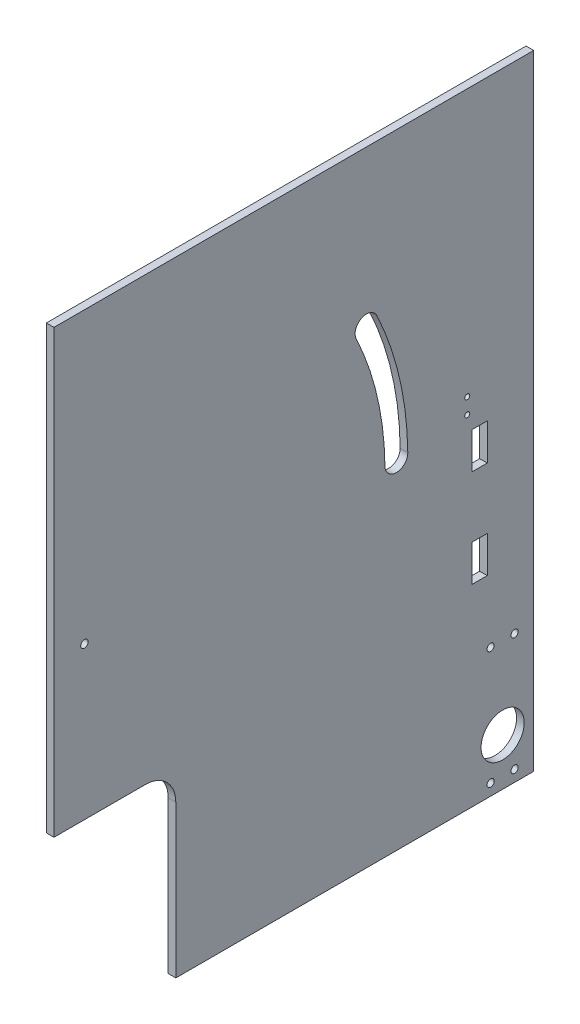
ISO-10303-21;
HEADER;
FILE_DESCRIPTION(('STEP AP214'),'2;1');
FILE_NAME('part.step','',(''),(''),'','','');
FILE_SCHEMA(('AUTOMOTIVE_DESIGN { 1 0 10303 214 1 1 1 1 }'));
ENDSEC;
DATA;
#1=APPLICATION_CONTEXT('core data for automotive mechanical design processes');
#2=APPLICATION_PROTOCOL_DEFINITION('international standard','automotive_design',2000,#1);
#3=PRODUCT_CONTEXT('',#1,'mechanical');
#4=PRODUCT('Part','Part','',(#3));
#5=PRODUCT_RELATED_PRODUCT_CATEGORY('part','',(#4));
#6=PRODUCT_DEFINITION_FORMATION('','',#4);
#7=PRODUCT_DEFINITION_CONTEXT('part definition',#1,'design');
#8=PRODUCT_DEFINITION('design','',#6,#7);
#9=PRODUCT_DEFINITION_SHAPE('','',#8);
#10=(LENGTH_UNIT() NAMED_UNIT(*) SI_UNIT(.MILLI.,.METRE.));
#11=(NAMED_UNIT(*) PLANE_ANGLE_UNIT() SI_UNIT($,.RADIAN.));
#12=(NAMED_UNIT(*) SI_UNIT($,.STERADIAN.) SOLID_ANGLE_UNIT());
#13=UNCERTAINTY_MEASURE_WITH_UNIT(LENGTH_MEASURE(1.E-05),#10,'distance_accuracy_value','');
#14=(GEOMETRIC_REPRESENTATION_CONTEXT(3) GLOBAL_UNCERTAINTY_ASSIGNED_CONTEXT((#13)) GLOBAL_UNIT_ASSIGNED_CONTEXT((#10,
#11,#12)) REPRESENTATION_CONTEXT('',''));
#15=CARTESIAN_POINT('',(0.,0.,0.));
#16=DIRECTION('',(0.,0.,1.));
#17=DIRECTION('',(1.,0.,0.));
#18=AXIS2_PLACEMENT_3D('',#15,#16,#17);
#19=CARTESIAN_POINT('',(3.175,0.,0.));
#20=DIRECTION('',(1.,0.,0.));
#21=DIRECTION('',(0.,0.,-1.));
#22=AXIS2_PLACEMENT_3D('',#19,#20,#21);
#23=PLANE('',#22);
#24=CARTESIAN_POINT('',(3.175,-76.4125,-82.075));
#25=DIRECTION('',(1.,0.,0.));
#26=DIRECTION('',(0.,0.,-1.));
#27=AXIS2_PLACEMENT_3D('',#24,#25,#26);
#28=CIRCLE('',#27,1.5);
#29=CARTESIAN_POINT('',(3.175,-76.4125,-83.575));
#30=VERTEX_POINT('',#29);
#31=EDGE_CURVE('E645',#30,#30,#28,.T.);
#32=ORIENTED_EDGE('',*,*,#31,.F.);
#33=EDGE_LOOP('',(#32));
#34=FACE_BOUND('',#33,.T.);
#35=CARTESIAN_POINT('',(3.175,-125.4125,-92.075));
#36=DIRECTION('',(1.,0.,0.));
#37=DIRECTION('',(0.,0.,-1.));
#38=AXIS2_PLACEMENT_3D('',#35,#36,#37);
#39=CIRCLE('',#38,1.5);
#40=CARTESIAN_POINT('',(3.175,-125.4125,-93.575));
#41=VERTEX_POINT('',#40);
#42=EDGE_CURVE('E650',#41,#41,#39,.T.);
#43=ORIENTED_EDGE('',*,*,#42,.F.);
#44=EDGE_LOOP('',(#43));
#45=FACE_BOUND('',#44,.T.);
#46=CARTESIAN_POINT('',(3.175,-76.4125,-92.075));
#47=DIRECTION('',(1.,0.,0.));
#48=DIRECTION('',(0.,0.,-1.));
#49=AXIS2_PLACEMENT_3D('',#46,#47,#48);
#50=CIRCLE('',#49,1.5);
#51=CARTESIAN_POINT('',(3.175,-76.4125,-93.575));
#52=VERTEX_POINT('',#51);
#53=EDGE_CURVE('E692',#52,#52,#50,.T.);
#54=ORIENTED_EDGE('',*,*,#53,.F.);
#55=EDGE_LOOP('',(#54));
#56=FACE_BOUND('',#55,.T.);
#57=CARTESIAN_POINT('',(3.175,-110.5624916,-87.075));
#58=DIRECTION('',(1.,0.,0.));
#59=DIRECTION('',(0.,0.,-1.));
#60=AXIS2_PLACEMENT_3D('',#57,#58,#59);
#61=CIRCLE('',#60,8.99999999999999);
#62=CARTESIAN_POINT('',(3.175,-110.5624916,-96.075));
#63=VERTEX_POINT('',#62);
#64=EDGE_CURVE('E701',#63,#63,#61,.T.);
#65=ORIENTED_EDGE('',*,*,#64,.F.);
#66=EDGE_LOOP('',(#65));
#67=FACE_BOUND('',#66,.T.);
#68=CARTESIAN_POINT('',(3.175,-125.4125,-82.075));
#69=DIRECTION('',(1.,0.,0.));
#70=DIRECTION('',(0.,0.,-1.));
#71=AXIS2_PLACEMENT_3D('',#68,#69,#70);
#72=CIRCLE('',#71,1.5);
#73=CARTESIAN_POINT('',(3.175,-125.4125,-83.575));
#74=VERTEX_POINT('',#73);
#75=EDGE_CURVE('E193',#74,#74,#72,.T.);
#76=ORIENTED_EDGE('',*,*,#75,.F.);
#77=EDGE_LOOP('',(#76));
#78=FACE_BOUND('',#77,.T.);
#79=DIRECTION('',(0.,-1.,0.));
#80=VECTOR('',#79,1.);
#81=CARTESIAN_POINT('',(3.175,6.07499420000002,-74.3175));
#82=LINE('',#81,#80);
#83=CARTESIAN_POINT('',(3.175,6.07499420000002,-74.3175));
#84=VERTEX_POINT('',#83);
#85=CARTESIAN_POINT('',(3.175,-9.16500579999998,-74.3175));
#86=VERTEX_POINT('',#85);
#87=EDGE_CURVE('E51',#84,#86,#82,.T.);
#88=ORIENTED_EDGE('',*,*,#87,.F.);
#89=DIRECTION('',(0.,0.,1.));
#90=VECTOR('',#89,1.);
#91=CARTESIAN_POINT('',(3.175,6.07499420000002,-74.3175));
#92=LINE('',#91,#90);
#93=CARTESIAN_POINT('',(3.175,6.07499420000002,-80.6675));
#94=VERTEX_POINT('',#93);
#95=EDGE_CURVE('E187',#94,#84,#92,.T.);
#96=ORIENTED_EDGE('',*,*,#95,.F.);
#97=DIRECTION('',(0.,1.,0.));
#98=VECTOR('',#97,1.);
#99=CARTESIAN_POINT('',(3.175,6.07499420000002,-80.6675));
#100=LINE('',#99,#98);
#101=CARTESIAN_POINT('',(3.175,-9.16500579999998,-80.6675));
#102=VERTEX_POINT('',#101);
#103=EDGE_CURVE('E190',#102,#94,#100,.T.);
#104=ORIENTED_EDGE('',*,*,#103,.F.);
#105=DIRECTION('',(0.,0.,-1.));
#106=VECTOR('',#105,1.);
#107=CARTESIAN_POINT('',(3.175,-9.16500579999998,-74.3175));
#108=LINE('',#107,#106);
#109=EDGE_CURVE('E199',#86,#102,#108,.T.);
#110=ORIENTED_EDGE('',*,*,#109,.F.);
#111=EDGE_LOOP('',(#88,#96,#104,#110));
#112=FACE_BOUND('',#111,.T.);
#113=DIRECTION('',(0.,-1.,0.));
#114=VECTOR('',#113,1.);
#115=CARTESIAN_POINT('',(3.175,-34.5650058,-74.3175));
#116=LINE('',#115,#114);
#117=CARTESIAN_POINT('',(3.175,-34.5650058,-74.3175));
#118=VERTEX_POINT('',#117);
#119=CARTESIAN_POINT('',(3.175,-49.8050058,-74.3175));
#120=VERTEX_POINT('',#119);
#121=EDGE_CURVE('E59',#118,#120,#116,.T.);
#122=ORIENTED_EDGE('',*,*,#121,.F.);
#123=DIRECTION('',(0.,0.,1.));
#124=VECTOR('',#123,1.);
#125=CARTESIAN_POINT('',(3.175,-34.5650058,-74.3175));
#126=LINE('',#125,#124);
#127=CARTESIAN_POINT('',(3.175,-34.5650058,-80.6675));
#128=VERTEX_POINT('',#127);
#129=EDGE_CURVE('E214',#128,#118,#126,.T.);
#130=ORIENTED_EDGE('',*,*,#129,.F.);
#131=DIRECTION('',(0.,1.,0.));
#132=VECTOR('',#131,1.);
#133=CARTESIAN_POINT('',(3.175,-34.5650058,-80.6675));
#134=LINE('',#133,#132);
#135=CARTESIAN_POINT('',(3.175,-49.8050058,-80.6675));
#136=VERTEX_POINT('',#135);
#137=EDGE_CURVE('E229',#136,#128,#134,.T.);
#138=ORIENTED_EDGE('',*,*,#137,.F.);
#139=DIRECTION('',(0.,0.,-1.));
#140=VECTOR('',#139,1.);
#141=CARTESIAN_POINT('',(3.175,-49.8050058,-74.3175));
#142=LINE('',#141,#140);
#143=EDGE_CURVE('E225',#120,#136,#142,.T.);
#144=ORIENTED_EDGE('',*,*,#143,.F.);
#145=EDGE_LOOP('',(#122,#130,#138,#144));
#146=FACE_BOUND('',#145,.T.);
#147=CARTESIAN_POINT('',(3.175,12.4249942,-72.3175));
#148=DIRECTION('',(-1.,0.,0.));
#149=DIRECTION('',(0.,0.,1.));
#150=AXIS2_PLACEMENT_3D('',#147,#148,#149);
#151=CIRCLE('',#150,1.04999790000001);
#152=CARTESIAN_POINT('',(3.175,12.4249942,-71.2675021));
#153=VERTEX_POINT('',#152);
#154=EDGE_CURVE('E300',#153,#153,#151,.T.);
#155=ORIENTED_EDGE('',*,*,#154,.T.);
#156=EDGE_LOOP('',(#155));
#157=FACE_BOUND('',#156,.T.);
#158=CARTESIAN_POINT('',(3.175,18.9250066,-72.3175));
#159=DIRECTION('',(-1.,0.,0.));
#160=DIRECTION('',(0.,0.,1.));
#161=AXIS2_PLACEMENT_3D('',#158,#159,#160);
#162=CIRCLE('',#161,1.04999790000001);
#163=CARTESIAN_POINT('',(3.175,18.9250066,-71.2675021));
#164=VERTEX_POINT('',#163);
#165=EDGE_CURVE('E294',#164,#164,#162,.T.);
#166=ORIENTED_EDGE('',*,*,#165,.T.);
#167=EDGE_LOOP('',(#166));
#168=FACE_BOUND('',#167,.T.);
#169=CARTESIAN_POINT('',(3.175,9.52500000000001,87.3125));
#170=DIRECTION('',(-1.,0.,0.));
#171=DIRECTION('',(0.,0.,1.));
#172=AXIS2_PLACEMENT_3D('',#169,#170,#171);
#173=CIRCLE('',#172,1.54999999999999);
#174=CARTESIAN_POINT('',(3.175,9.52500000000001,88.8625));
#175=VERTEX_POINT('',#174);
#176=EDGE_CURVE('E287',#175,#175,#173,.T.);
#177=ORIENTED_EDGE('',*,*,#176,.T.);
#178=EDGE_LOOP('',(#177));
#179=FACE_BOUND('',#178,.T.);
#180=DIRECTION('',(0.,0.,-1.));
#181=VECTOR('',#180,1.);
#182=CARTESIAN_POINT('',(3.175,-53.975,100.0125));
#183=LINE('',#182,#181);
#184=CARTESIAN_POINT('',(3.175,-53.975,100.0125));
#185=VERTEX_POINT('',#184);
#186=CARTESIAN_POINT('',(3.175,-53.975,61.9125));
#187=VERTEX_POINT('',#186);
#188=EDGE_CURVE('E272',#185,#187,#183,.T.);
#189=ORIENTED_EDGE('',*,*,#188,.T.);
#190=CARTESIAN_POINT('',(3.175,-66.675,61.9125));
#191=DIRECTION('',(1.,0.,0.));
#192=DIRECTION('',(0.,0.,-1.));
#193=AXIS2_PLACEMENT_3D('',#190,#191,#192);
#194=CIRCLE('',#193,12.7);
#195=CARTESIAN_POINT('',(3.175,-66.675,49.2125));
#196=VERTEX_POINT('',#195);
#197=EDGE_CURVE('E11',#187,#196,#194,.F.);
#198=ORIENTED_EDGE('',*,*,#197,.T.);
#199=DIRECTION('',(0.,-1.,0.));
#200=VECTOR('',#199,1.);
#201=CARTESIAN_POINT('',(3.175,-53.975,49.2125));
#202=LINE('',#201,#200);
#203=CARTESIAN_POINT('',(3.175,-130.175,49.2125));
#204=VERTEX_POINT('',#203);
#205=EDGE_CURVE('E275',#196,#204,#202,.T.);
#206=ORIENTED_EDGE('',*,*,#205,.T.);
#207=DIRECTION('',(0.,0.,-1.));
#208=VECTOR('',#207,1.);
#209=CARTESIAN_POINT('',(3.175,-130.175,100.0125));
#210=LINE('',#209,#208);
#211=CARTESIAN_POINT('',(3.175,-130.175,-100.0125));
#212=VERTEX_POINT('',#211);
#213=EDGE_CURVE('E308',#204,#212,#210,.T.);
#214=ORIENTED_EDGE('',*,*,#213,.T.);
#215=DIRECTION('',(0.,1.,0.));
#216=VECTOR('',#215,1.);
#217=CARTESIAN_POINT('',(3.175,130.175,-100.0125));
#218=LINE('',#217,#216);
#219=CARTESIAN_POINT('',(3.175,130.175,-100.0125));
#220=VERTEX_POINT('',#219);
#221=EDGE_CURVE('E311',#212,#220,#218,.T.);
#222=ORIENTED_EDGE('',*,*,#221,.T.);
#223=DIRECTION('',(0.,0.,1.));
#224=VECTOR('',#223,1.);
#225=CARTESIAN_POINT('',(3.175,130.175,100.0125));
#226=LINE('',#225,#224);
#227=CARTESIAN_POINT('',(3.175,130.175,100.0125));
#228=VERTEX_POINT('',#227);
#229=EDGE_CURVE('E313',#220,#228,#226,.T.);
#230=ORIENTED_EDGE('',*,*,#229,.T.);
#231=DIRECTION('',(0.,-1.,0.));
#232=VECTOR('',#231,1.);
#233=CARTESIAN_POINT('',(3.175,130.175,100.0125));
#234=LINE('',#233,#232);
#235=EDGE_CURVE('E305',#228,#185,#234,.T.);
#236=ORIENTED_EDGE('',*,*,#235,.T.);
#237=EDGE_LOOP('',(#189,#198,#206,#214,#222,#230,#236));
#238=FACE_BOUND('',#237,.T.);
#239=CARTESIAN_POINT('',(3.175,11.0871566045476,-42.7659721455072));
#240=DIRECTION('',(-1.,0.,0.));
#241=DIRECTION('',(0.,0.,1.));
#242=AXIS2_PLACEMENT_3D('',#239,#240,#241);
#243=CIRCLE('',#242,4.76250000000012);
#244=CARTESIAN_POINT('',(3.175,11.1443469625431,-47.5281287486601));
#245=VERTEX_POINT('',#244);
#246=CARTESIAN_POINT('',(3.175,11.0299662465522,-38.0038155423543));
#247=VERTEX_POINT('',#246);
#248=EDGE_CURVE('E240',#245,#247,#243,.T.);
#249=ORIENTED_EDGE('',*,*,#248,.T.);
#250=CARTESIAN_POINT('',(3.175,9.52500000000001,87.3125));
#251=DIRECTION('',(1.,0.,0.));
#252=DIRECTION('',(0.,0.,1.));
#253=AXIS2_PLACEMENT_3D('',#250,#251,#252);
#254=CIRCLE('',#253,125.325352042251);
#255=CARTESIAN_POINT('',(3.175,63.0289480343282,-26.017864021537));
#256=VERTEX_POINT('',#255);
#257=EDGE_CURVE('E243',#247,#256,#254,.T.);
#258=ORIENTED_EDGE('',*,*,#257,.T.);
#259=CARTESIAN_POINT('',(3.175,65.0621566045476,-30.3245412975802));
#260=DIRECTION('',(-1.,0.,0.));
#261=DIRECTION('',(0.,0.,-1.));
#262=AXIS2_PLACEMENT_3D('',#259,#260,#261);
#263=CIRCLE('',#262,4.76249999999999);
#264=CARTESIAN_POINT('',(3.175,67.0953649647199,-34.6312186727879));
#265=VERTEX_POINT('',#264);
#266=EDGE_CURVE('E247',#256,#265,#263,.T.);
#267=ORIENTED_EDGE('',*,*,#266,.T.);
#268=CARTESIAN_POINT('',(3.175,9.52500000000001,87.3125));
#269=DIRECTION('',(-1.,0.,0.));
#270=DIRECTION('',(0.,0.,1.));
#271=AXIS2_PLACEMENT_3D('',#268,#269,#270);
#272=CIRCLE('',#271,134.850352042251);
#273=EDGE_CURVE('E250',#265,#245,#272,.T.);
#274=ORIENTED_EDGE('',*,*,#273,.T.);
#275=EDGE_LOOP('',(#249,#258,#267,#274));
#276=FACE_BOUND('',#275,.T.);
#277=ADVANCED_FACE('F36',(#34,#45,#56,#67,#78,#112,#146,#157,#168,#179,#238,#276),#23,.T.);
#278=CARTESIAN_POINT('',(0.,0.,0.));
#279=DIRECTION('',(1.,0.,0.));
#280=DIRECTION('',(0.,0.,-1.));
#281=AXIS2_PLACEMENT_3D('',#278,#279,#280);
#282=PLANE('',#281);
#283=CARTESIAN_POINT('',(0.,-76.4125,-82.075));
#284=DIRECTION('',(1.,0.,0.));
#285=DIRECTION('',(0.,0.,-1.));
#286=AXIS2_PLACEMENT_3D('',#283,#284,#285);
#287=CIRCLE('',#286,1.5);
#288=CARTESIAN_POINT('',(0.,-76.4125,-83.575));
#289=VERTEX_POINT('',#288);
#290=EDGE_CURVE('E643',#289,#289,#287,.T.);
#291=ORIENTED_EDGE('',*,*,#290,.T.);
#292=EDGE_LOOP('',(#291));
#293=FACE_BOUND('',#292,.T.);
#294=CARTESIAN_POINT('',(0.,-125.4125,-92.075));
#295=DIRECTION('',(1.,0.,0.));
#296=DIRECTION('',(0.,0.,-1.));
#297=AXIS2_PLACEMENT_3D('',#294,#295,#296);
#298=CIRCLE('',#297,1.5);
#299=CARTESIAN_POINT('',(0.,-125.4125,-93.575));
#300=VERTEX_POINT('',#299);
#301=EDGE_CURVE('E646',#300,#300,#298,.T.);
#302=ORIENTED_EDGE('',*,*,#301,.T.);
#303=EDGE_LOOP('',(#302));
#304=FACE_BOUND('',#303,.T.);
#305=CARTESIAN_POINT('',(0.,-76.4125,-92.075));
#306=DIRECTION('',(1.,0.,0.));
#307=DIRECTION('',(0.,0.,-1.));
#308=AXIS2_PLACEMENT_3D('',#305,#306,#307);
#309=CIRCLE('',#308,1.5);
#310=CARTESIAN_POINT('',(0.,-76.4125,-93.575));
#311=VERTEX_POINT('',#310);
#312=EDGE_CURVE('E655',#311,#311,#309,.T.);
#313=ORIENTED_EDGE('',*,*,#312,.T.);
#314=EDGE_LOOP('',(#313));
#315=FACE_BOUND('',#314,.T.);
#316=CARTESIAN_POINT('',(0.,-110.5624916,-87.075));
#317=DIRECTION('',(1.,0.,0.));
#318=DIRECTION('',(0.,0.,-1.));
#319=AXIS2_PLACEMENT_3D('',#316,#317,#318);
#320=CIRCLE('',#319,8.99999999999999);
#321=CARTESIAN_POINT('',(0.,-110.5624916,-96.075));
#322=VERTEX_POINT('',#321);
#323=EDGE_CURVE('E697',#322,#322,#320,.T.);
#324=ORIENTED_EDGE('',*,*,#323,.T.);
#325=EDGE_LOOP('',(#324));
#326=FACE_BOUND('',#325,.T.);
#327=CARTESIAN_POINT('',(0.,-125.4125,-82.075));
#328=DIRECTION('',(1.,0.,0.));
#329=DIRECTION('',(0.,0.,-1.));
#330=AXIS2_PLACEMENT_3D('',#327,#328,#329);
#331=CIRCLE('',#330,1.5);
#332=CARTESIAN_POINT('',(0.,-125.4125,-83.575));
#333=VERTEX_POINT('',#332);
#334=EDGE_CURVE('E226',#333,#333,#331,.T.);
#335=ORIENTED_EDGE('',*,*,#334,.T.);
#336=EDGE_LOOP('',(#335));
#337=FACE_BOUND('',#336,.T.);
#338=DIRECTION('',(0.,0.,1.));
#339=VECTOR('',#338,1.);
#340=CARTESIAN_POINT('',(0.,6.07499420000002,-74.3175));
#341=LINE('',#340,#339);
#342=CARTESIAN_POINT('',(0.,6.07499420000002,-80.6675));
#343=VERTEX_POINT('',#342);
#344=CARTESIAN_POINT('',(0.,6.07499420000002,-74.3175));
#345=VERTEX_POINT('',#344);
#346=EDGE_CURVE('E174',#343,#345,#341,.T.);
#347=ORIENTED_EDGE('',*,*,#346,.T.);
#348=DIRECTION('',(0.,-1.,0.));
#349=VECTOR('',#348,1.);
#350=CARTESIAN_POINT('',(0.,6.07499420000002,-74.3175));
#351=LINE('',#350,#349);
#352=CARTESIAN_POINT('',(0.,-9.16500579999998,-74.3175));
#353=VERTEX_POINT('',#352);
#354=EDGE_CURVE('E168',#345,#353,#351,.T.);
#355=ORIENTED_EDGE('',*,*,#354,.T.);
#356=DIRECTION('',(0.,0.,-1.));
#357=VECTOR('',#356,1.);
#358=CARTESIAN_POINT('',(0.,-9.16500579999998,-74.3175));
#359=LINE('',#358,#357);
#360=CARTESIAN_POINT('',(0.,-9.16500579999998,-80.6675));
#361=VERTEX_POINT('',#360);
#362=EDGE_CURVE('E178',#353,#361,#359,.T.);
#363=ORIENTED_EDGE('',*,*,#362,.T.);
#364=DIRECTION('',(0.,1.,0.));
#365=VECTOR('',#364,1.);
#366=CARTESIAN_POINT('',(0.,6.07499420000002,-80.6675));
#367=LINE('',#366,#365);
#368=EDGE_CURVE('E182',#361,#343,#367,.T.);
#369=ORIENTED_EDGE('',*,*,#368,.T.);
#370=EDGE_LOOP('',(#347,#355,#363,#369));
#371=FACE_BOUND('',#370,.T.);
#372=DIRECTION('',(0.,0.,1.));
#373=VECTOR('',#372,1.);
#374=CARTESIAN_POINT('',(0.,-34.5650058,-74.3175));
#375=LINE('',#374,#373);
#376=CARTESIAN_POINT('',(0.,-34.5650058,-80.6675));
#377=VERTEX_POINT('',#376);
#378=CARTESIAN_POINT('',(0.,-34.5650058,-74.3175));
#379=VERTEX_POINT('',#378);
#380=EDGE_CURVE('E220',#377,#379,#375,.T.);
#381=ORIENTED_EDGE('',*,*,#380,.T.);
#382=DIRECTION('',(0.,-1.,0.));
#383=VECTOR('',#382,1.);
#384=CARTESIAN_POINT('',(0.,-34.5650058,-74.3175));
#385=LINE('',#384,#383);
#386=CARTESIAN_POINT('',(0.,-49.8050058,-74.3175));
#387=VERTEX_POINT('',#386);
#388=EDGE_CURVE('E210',#379,#387,#385,.T.);
#389=ORIENTED_EDGE('',*,*,#388,.T.);
#390=DIRECTION('',(0.,0.,-1.));
#391=VECTOR('',#390,1.);
#392=CARTESIAN_POINT('',(0.,-49.8050058,-74.3175));
#393=LINE('',#392,#391);
#394=CARTESIAN_POINT('',(0.,-49.8050058,-80.6675));
#395=VERTEX_POINT('',#394);
#396=EDGE_CURVE('E213',#387,#395,#393,.T.);
#397=ORIENTED_EDGE('',*,*,#396,.T.);
#398=DIRECTION('',(0.,1.,0.));
#399=VECTOR('',#398,1.);
#400=CARTESIAN_POINT('',(0.,-34.5650058,-80.6675));
#401=LINE('',#400,#399);
#402=EDGE_CURVE('E217',#395,#377,#401,.T.);
#403=ORIENTED_EDGE('',*,*,#402,.T.);
#404=EDGE_LOOP('',(#381,#389,#397,#403));
#405=FACE_BOUND('',#404,.T.);
#406=CARTESIAN_POINT('',(0.,9.52500000000001,87.3125));
#407=DIRECTION('',(-1.,0.,0.));
#408=DIRECTION('',(0.,0.,1.));
#409=AXIS2_PLACEMENT_3D('',#406,#407,#408);
#410=CIRCLE('',#409,1.54999999999999);
#411=CARTESIAN_POINT('',(0.,9.52500000000001,88.8625));
#412=VERTEX_POINT('',#411);
#413=EDGE_CURVE('E291',#412,#412,#410,.T.);
#414=ORIENTED_EDGE('',*,*,#413,.F.);
#415=EDGE_LOOP('',(#414));
#416=FACE_BOUND('',#415,.T.);
#417=CARTESIAN_POINT('',(0.,18.9250066,-72.3175));
#418=DIRECTION('',(-1.,0.,0.));
#419=DIRECTION('',(0.,0.,1.));
#420=AXIS2_PLACEMENT_3D('',#417,#418,#419);
#421=CIRCLE('',#420,1.04999790000001);
#422=CARTESIAN_POINT('',(0.,18.9250066,-71.2675021));
#423=VERTEX_POINT('',#422);
#424=EDGE_CURVE('E297',#423,#423,#421,.T.);
#425=ORIENTED_EDGE('',*,*,#424,.F.);
#426=EDGE_LOOP('',(#425));
#427=FACE_BOUND('',#426,.T.);
#428=CARTESIAN_POINT('',(0.,12.4249942,-72.3175));
#429=DIRECTION('',(-1.,0.,0.));
#430=DIRECTION('',(0.,0.,1.));
#431=AXIS2_PLACEMENT_3D('',#428,#429,#430);
#432=CIRCLE('',#431,1.04999790000001);
#433=CARTESIAN_POINT('',(0.,12.4249942,-71.2675021));
#434=VERTEX_POINT('',#433);
#435=EDGE_CURVE('E285',#434,#434,#432,.T.);
#436=ORIENTED_EDGE('',*,*,#435,.F.);
#437=EDGE_LOOP('',(#436));
#438=FACE_BOUND('',#437,.T.);
#439=DIRECTION('',(0.,0.,-1.));
#440=VECTOR('',#439,1.);
#441=CARTESIAN_POINT('',(0.,-130.175,100.0125));
#442=LINE('',#441,#440);
#443=CARTESIAN_POINT('',(0.,-130.175,49.2125));
#444=VERTEX_POINT('',#443);
#445=CARTESIAN_POINT('',(0.,-130.175,-100.0125));
#446=VERTEX_POINT('',#445);
#447=EDGE_CURVE('E318',#444,#446,#442,.T.);
#448=ORIENTED_EDGE('',*,*,#447,.F.);
#449=DIRECTION('',(0.,-1.,0.));
#450=VECTOR('',#449,1.);
#451=CARTESIAN_POINT('',(0.,-53.975,49.2125));
#452=LINE('',#451,#450);
#453=CARTESIAN_POINT('',(0.,-66.675,49.2125));
#454=VERTEX_POINT('',#453);
#455=EDGE_CURVE('E276',#454,#444,#452,.T.);
#456=ORIENTED_EDGE('',*,*,#455,.F.);
#457=CARTESIAN_POINT('',(0.,-66.675,61.9125));
#458=DIRECTION('',(1.,0.,0.));
#459=DIRECTION('',(0.,0.,-1.));
#460=AXIS2_PLACEMENT_3D('',#457,#458,#459);
#461=CIRCLE('',#460,12.7);
#462=CARTESIAN_POINT('',(0.,-53.975,61.9125));
#463=VERTEX_POINT('',#462);
#464=EDGE_CURVE('E44',#454,#463,#461,.T.);
#465=ORIENTED_EDGE('',*,*,#464,.T.);
#466=DIRECTION('',(0.,0.,-1.));
#467=VECTOR('',#466,1.);
#468=CARTESIAN_POINT('',(0.,-53.975,100.0125));
#469=LINE('',#468,#467);
#470=CARTESIAN_POINT('',(0.,-53.975,100.0125));
#471=VERTEX_POINT('',#470);
#472=EDGE_CURVE('E265',#471,#463,#469,.T.);
#473=ORIENTED_EDGE('',*,*,#472,.F.);
#474=DIRECTION('',(0.,-1.,0.));
#475=VECTOR('',#474,1.);
#476=CARTESIAN_POINT('',(0.,130.175,100.0125));
#477=LINE('',#476,#475);
#478=CARTESIAN_POINT('',(0.,130.175,100.0125));
#479=VERTEX_POINT('',#478);
#480=EDGE_CURVE('E290',#479,#471,#477,.T.);
#481=ORIENTED_EDGE('',*,*,#480,.F.);
#482=DIRECTION('',(0.,0.,1.));
#483=VECTOR('',#482,1.);
#484=CARTESIAN_POINT('',(0.,130.175,100.0125));
#485=LINE('',#484,#483);
#486=CARTESIAN_POINT('',(0.,130.175,-100.0125));
#487=VERTEX_POINT('',#486);
#488=EDGE_CURVE('E309',#487,#479,#485,.T.);
#489=ORIENTED_EDGE('',*,*,#488,.F.);
#490=DIRECTION('',(0.,1.,0.));
#491=VECTOR('',#490,1.);
#492=CARTESIAN_POINT('',(0.,130.175,-100.0125));
#493=LINE('',#492,#491);
#494=EDGE_CURVE('E320',#446,#487,#493,.T.);
#495=ORIENTED_EDGE('',*,*,#494,.F.);
#496=EDGE_LOOP('',(#448,#456,#465,#473,#481,#489,#495));
#497=FACE_BOUND('',#496,.T.);
#498=CARTESIAN_POINT('',(0.,9.52500000000001,87.3125));
#499=DIRECTION('',(1.,0.,0.));
#500=DIRECTION('',(0.,0.,1.));
#501=AXIS2_PLACEMENT_3D('',#498,#499,#500);
#502=CIRCLE('',#501,125.325352042251);
#503=CARTESIAN_POINT('',(0.,11.0299662465522,-38.0038155423543));
#504=VERTEX_POINT('',#503);
#505=CARTESIAN_POINT('',(0.,63.0289480343283,-26.017864021537));
#506=VERTEX_POINT('',#505);
#507=EDGE_CURVE('E255',#504,#506,#502,.T.);
#508=ORIENTED_EDGE('',*,*,#507,.F.);
#509=CARTESIAN_POINT('',(0.,11.0871566045476,-42.7659721455072));
#510=DIRECTION('',(-1.,0.,0.));
#511=DIRECTION('',(0.,0.,1.));
#512=AXIS2_PLACEMENT_3D('',#509,#510,#511);
#513=CIRCLE('',#512,4.76250000000012);
#514=CARTESIAN_POINT('',(0.,11.1443469625431,-47.5281287486601));
#515=VERTEX_POINT('',#514);
#516=EDGE_CURVE('E206',#515,#504,#513,.T.);
#517=ORIENTED_EDGE('',*,*,#516,.F.);
#518=CARTESIAN_POINT('',(0.,9.52500000000001,87.3125));
#519=DIRECTION('',(-1.,0.,0.));
#520=DIRECTION('',(0.,0.,1.));
#521=AXIS2_PLACEMENT_3D('',#518,#519,#520);
#522=CIRCLE('',#521,134.850352042251);
#523=CARTESIAN_POINT('',(0.,67.0953649647199,-34.6312186727879));
#524=VERTEX_POINT('',#523);
#525=EDGE_CURVE('E244',#524,#515,#522,.T.);
#526=ORIENTED_EDGE('',*,*,#525,.F.);
#527=CARTESIAN_POINT('',(0.,65.0621566045476,-30.3245412975802));
#528=DIRECTION('',(-1.,0.,0.));
#529=DIRECTION('',(0.,0.,-1.));
#530=AXIS2_PLACEMENT_3D('',#527,#528,#529);
#531=CIRCLE('',#530,4.76249999999999);
#532=EDGE_CURVE('E258',#506,#524,#531,.T.);
#533=ORIENTED_EDGE('',*,*,#532,.F.);
#534=EDGE_LOOP('',(#508,#517,#526,#533));
#535=FACE_BOUND('',#534,.T.);
#536=ADVANCED_FACE('F184',(#293,#304,#315,#326,#337,#371,#405,#416,#427,#438,#497,#535),#282,.F.);
#537=CARTESIAN_POINT('',(3.175,130.175,100.0125));
#538=DIRECTION('',(0.,0.,-1.));
#539=DIRECTION('',(-1.,0.,0.));
#540=AXIS2_PLACEMENT_3D('',#537,#538,#539);
#541=PLANE('',#540);
#542=ORIENTED_EDGE('',*,*,#480,.T.);
#543=DIRECTION('',(-1.,0.,0.));
#544=VECTOR('',#543,1.);
#545=CARTESIAN_POINT('',(3.175,-53.975,100.0125));
#546=LINE('',#545,#544);
#547=EDGE_CURVE('E278',#185,#471,#546,.T.);
#548=ORIENTED_EDGE('',*,*,#547,.F.);
#549=ORIENTED_EDGE('',*,*,#235,.F.);
#550=DIRECTION('',(-1.,0.,0.));
#551=VECTOR('',#550,1.);
#552=CARTESIAN_POINT('',(3.175,130.175,100.0125));
#553=LINE('',#552,#551);
#554=EDGE_CURVE('E315',#228,#479,#553,.T.);
#555=ORIENTED_EDGE('',*,*,#554,.T.);
#556=EDGE_LOOP('',(#542,#548,#549,#555));
#557=FACE_BOUND('',#556,.T.);
#558=ADVANCED_FACE('F370',(#557),#541,.F.);
#559=CARTESIAN_POINT('',(3.175,-130.175,100.0125));
#560=DIRECTION('',(0.,1.,0.));
#561=DIRECTION('',(0.,0.,1.));
#562=AXIS2_PLACEMENT_3D('',#559,#560,#561);
#563=PLANE('',#562);
#564=ORIENTED_EDGE('',*,*,#213,.F.);
#565=DIRECTION('',(-1.,0.,0.));
#566=VECTOR('',#565,1.);
#567=CARTESIAN_POINT('',(3.175,-130.175,49.2125));
#568=LINE('',#567,#566);
#569=EDGE_CURVE('E282',#204,#444,#568,.T.);
#570=ORIENTED_EDGE('',*,*,#569,.T.);
#571=ORIENTED_EDGE('',*,*,#447,.T.);
#572=DIRECTION('',(-1.,0.,0.));
#573=VECTOR('',#572,1.);
#574=CARTESIAN_POINT('',(3.175,-130.175,-100.0125));
#575=LINE('',#574,#573);
#576=EDGE_CURVE('E328',#212,#446,#575,.T.);
#577=ORIENTED_EDGE('',*,*,#576,.F.);
#578=EDGE_LOOP('',(#564,#570,#571,#577));
#579=FACE_BOUND('',#578,.T.);
#580=ADVANCED_FACE('F357',(#579),#563,.F.);
#581=CARTESIAN_POINT('',(3.175,130.175,-100.0125));
#582=DIRECTION('',(0.,0.,1.));
#583=DIRECTION('',(0.,-1.,0.));
#584=AXIS2_PLACEMENT_3D('',#581,#582,#583);
#585=PLANE('',#584);
#586=ORIENTED_EDGE('',*,*,#494,.T.);
#587=DIRECTION('',(-1.,0.,0.));
#588=VECTOR('',#587,1.);
#589=CARTESIAN_POINT('',(3.175,130.175,-100.0125));
#590=LINE('',#589,#588);
#591=EDGE_CURVE('E325',#220,#487,#590,.T.);
#592=ORIENTED_EDGE('',*,*,#591,.F.);
#593=ORIENTED_EDGE('',*,*,#221,.F.);
#594=ORIENTED_EDGE('',*,*,#576,.T.);
#595=EDGE_LOOP('',(#586,#592,#593,#594));
#596=FACE_BOUND('',#595,.T.);
#597=ADVANCED_FACE('F363',(#596),#585,.F.);
#598=CARTESIAN_POINT('',(3.175,130.175,100.0125));
#599=DIRECTION('',(0.,-1.,0.));
#600=DIRECTION('',(0.,0.,-1.));
#601=AXIS2_PLACEMENT_3D('',#598,#599,#600);
#602=PLANE('',#601);
#603=ORIENTED_EDGE('',*,*,#488,.T.);
#604=ORIENTED_EDGE('',*,*,#554,.F.);
#605=ORIENTED_EDGE('',*,*,#229,.F.);
#606=ORIENTED_EDGE('',*,*,#591,.T.);
#607=EDGE_LOOP('',(#603,#604,#605,#606));
#608=FACE_BOUND('',#607,.T.);
#609=ADVANCED_FACE('F367',(#608),#602,.F.);
#610=CARTESIAN_POINT('',(3.175,12.4249942,-72.3175));
#611=DIRECTION('',(-1.,0.,0.));
#612=DIRECTION('',(0.,0.,1.));
#613=AXIS2_PLACEMENT_3D('',#610,#611,#612);
#614=CYLINDRICAL_SURFACE('',#613,1.04999790000001);
#615=ORIENTED_EDGE('',*,*,#154,.F.);
#616=EDGE_LOOP('',(#615));
#617=FACE_BOUND('',#616,.T.);
#618=ORIENTED_EDGE('',*,*,#435,.T.);
#619=EDGE_LOOP('',(#618));
#620=FACE_BOUND('',#619,.T.);
#621=ADVANCED_FACE('F387',(#617,#620),#614,.F.);
#622=CARTESIAN_POINT('',(3.175,18.9250066,-72.3175));
#623=DIRECTION('',(-1.,0.,0.));
#624=DIRECTION('',(0.,0.,1.));
#625=AXIS2_PLACEMENT_3D('',#622,#623,#624);
#626=CYLINDRICAL_SURFACE('',#625,1.04999790000001);
#627=ORIENTED_EDGE('',*,*,#165,.F.);
#628=EDGE_LOOP('',(#627));
#629=FACE_BOUND('',#628,.T.);
#630=ORIENTED_EDGE('',*,*,#424,.T.);
#631=EDGE_LOOP('',(#630));
#632=FACE_BOUND('',#631,.T.);
#633=ADVANCED_FACE('F407',(#629,#632),#626,.F.);
#634=CARTESIAN_POINT('',(3.175,9.52500000000001,87.3125));
#635=DIRECTION('',(-1.,0.,0.));
#636=DIRECTION('',(0.,0.,1.));
#637=AXIS2_PLACEMENT_3D('',#634,#635,#636);
#638=CYLINDRICAL_SURFACE('',#637,1.54999999999999);
#639=ORIENTED_EDGE('',*,*,#176,.F.);
#640=EDGE_LOOP('',(#639));
#641=FACE_BOUND('',#640,.T.);
#642=ORIENTED_EDGE('',*,*,#413,.T.);
#643=EDGE_LOOP('',(#642));
#644=FACE_BOUND('',#643,.T.);
#645=ADVANCED_FACE('F414',(#641,#644),#638,.F.);
#646=CARTESIAN_POINT('',(3.175,-53.975,49.2125));
#647=DIRECTION('',(0.,0.,-1.));
#648=DIRECTION('',(0.,1.,0.));
#649=AXIS2_PLACEMENT_3D('',#646,#647,#648);
#650=PLANE('',#649);
#651=ORIENTED_EDGE('',*,*,#205,.F.);
#652=DIRECTION('',(-1.,0.,0.));
#653=VECTOR('',#652,1.);
#654=CARTESIAN_POINT('',(0.,-66.675,49.2125));
#655=LINE('',#654,#653);
#656=EDGE_CURVE('E331',#196,#454,#655,.T.);
#657=ORIENTED_EDGE('',*,*,#656,.T.);
#658=ORIENTED_EDGE('',*,*,#455,.T.);
#659=ORIENTED_EDGE('',*,*,#569,.F.);
#660=EDGE_LOOP('',(#651,#657,#658,#659));
#661=FACE_BOUND('',#660,.T.);
#662=ADVANCED_FACE('F353',(#661),#650,.F.);
#663=CARTESIAN_POINT('',(3.175,-53.975,100.0125));
#664=DIRECTION('',(0.,1.,0.));
#665=DIRECTION('',(0.,0.,1.));
#666=AXIS2_PLACEMENT_3D('',#663,#664,#665);
#667=PLANE('',#666);
#668=ORIENTED_EDGE('',*,*,#472,.T.);
#669=DIRECTION('',(-1.,0.,0.));
#670=VECTOR('',#669,1.);
#671=CARTESIAN_POINT('',(3.175,-53.975,61.9125));
#672=LINE('',#671,#670);
#673=EDGE_CURVE('E334',#463,#187,#672,.F.);
#674=ORIENTED_EDGE('',*,*,#673,.T.);
#675=ORIENTED_EDGE('',*,*,#188,.F.);
#676=ORIENTED_EDGE('',*,*,#547,.T.);
#677=EDGE_LOOP('',(#668,#674,#675,#676));
#678=FACE_BOUND('',#677,.T.);
#679=ADVANCED_FACE('F345',(#678),#667,.F.);
#680=CARTESIAN_POINT('',(3.175,-66.675,61.9125));
#681=DIRECTION('',(1.,0.,0.));
#682=DIRECTION('',(0.,0.,-1.));
#683=AXIS2_PLACEMENT_3D('',#680,#681,#682);
#684=CYLINDRICAL_SURFACE('',#683,12.7);
#685=ORIENTED_EDGE('',*,*,#197,.F.);
#686=ORIENTED_EDGE('',*,*,#673,.F.);
#687=ORIENTED_EDGE('',*,*,#464,.F.);
#688=ORIENTED_EDGE('',*,*,#656,.F.);
#689=EDGE_LOOP('',(#685,#686,#687,#688));
#690=FACE_BOUND('',#689,.T.);
#691=ADVANCED_FACE('F38',(#690),#684,.F.);
#692=CARTESIAN_POINT('',(3.175,11.0871566045476,-42.7659721455072));
#693=DIRECTION('',(-1.,0.,0.));
#694=DIRECTION('',(0.,0.,1.));
#695=AXIS2_PLACEMENT_3D('',#692,#693,#694);
#696=CYLINDRICAL_SURFACE('',#695,4.76250000000012);
#697=ORIENTED_EDGE('',*,*,#516,.T.);
#698=DIRECTION('',(-1.,0.,0.));
#699=VECTOR('',#698,1.);
#700=CARTESIAN_POINT('',(3.175,11.0299662465522,-38.0038155423543));
#701=LINE('',#700,#699);
#702=EDGE_CURVE('E253',#247,#504,#701,.T.);
#703=ORIENTED_EDGE('',*,*,#702,.F.);
#704=ORIENTED_EDGE('',*,*,#248,.F.);
#705=DIRECTION('',(-1.,0.,0.));
#706=VECTOR('',#705,1.);
#707=CARTESIAN_POINT('',(3.175,11.1443469625431,-47.5281287486601));
#708=LINE('',#707,#706);
#709=EDGE_CURVE('E263',#245,#515,#708,.T.);
#710=ORIENTED_EDGE('',*,*,#709,.T.);
#711=EDGE_LOOP('',(#697,#703,#704,#710));
#712=FACE_BOUND('',#711,.T.);
#713=ADVANCED_FACE('F440',(#712),#696,.F.);
#714=CARTESIAN_POINT('',(3.175,9.52500000000001,87.3125));
#715=DIRECTION('',(-1.,0.,0.));
#716=DIRECTION('',(0.,0.,1.));
#717=AXIS2_PLACEMENT_3D('',#714,#715,#716);
#718=CYLINDRICAL_SURFACE('',#717,134.850352042251);
#719=ORIENTED_EDGE('',*,*,#525,.T.);
#720=ORIENTED_EDGE('',*,*,#709,.F.);
#721=ORIENTED_EDGE('',*,*,#273,.F.);
#722=DIRECTION('',(-1.,0.,0.));
#723=VECTOR('',#722,1.);
#724=CARTESIAN_POINT('',(3.175,67.0953649647199,-34.6312186727879));
#725=LINE('',#724,#723);
#726=EDGE_CURVE('E266',#265,#524,#725,.T.);
#727=ORIENTED_EDGE('',*,*,#726,.T.);
#728=EDGE_LOOP('',(#719,#720,#721,#727));
#729=FACE_BOUND('',#728,.T.);
#730=ADVANCED_FACE('F446',(#729),#718,.F.);
#731=CARTESIAN_POINT('',(3.175,65.0621566045476,-30.3245412975802));
#732=DIRECTION('',(-1.,0.,0.));
#733=DIRECTION('',(0.,0.,1.));
#734=AXIS2_PLACEMENT_3D('',#731,#732,#733);
#735=CYLINDRICAL_SURFACE('',#734,4.76249999999999);
#736=ORIENTED_EDGE('',*,*,#532,.T.);
#737=ORIENTED_EDGE('',*,*,#726,.F.);
#738=ORIENTED_EDGE('',*,*,#266,.F.);
#739=DIRECTION('',(-1.,0.,0.));
#740=VECTOR('',#739,1.);
#741=CARTESIAN_POINT('',(3.175,63.0289480343283,-26.017864021537));
#742=LINE('',#741,#740);
#743=EDGE_CURVE('E268',#256,#506,#742,.T.);
#744=ORIENTED_EDGE('',*,*,#743,.T.);
#745=EDGE_LOOP('',(#736,#737,#738,#744));
#746=FACE_BOUND('',#745,.T.);
#747=ADVANCED_FACE('F454',(#746),#735,.F.);
#748=CARTESIAN_POINT('',(3.175,9.52500000000001,87.3125));
#749=DIRECTION('',(-1.,0.,0.));
#750=DIRECTION('',(0.,0.,1.));
#751=AXIS2_PLACEMENT_3D('',#748,#749,#750);
#752=CYLINDRICAL_SURFACE('',#751,125.325352042251);
#753=ORIENTED_EDGE('',*,*,#507,.T.);
#754=ORIENTED_EDGE('',*,*,#743,.F.);
#755=ORIENTED_EDGE('',*,*,#257,.F.);
#756=ORIENTED_EDGE('',*,*,#702,.T.);
#757=EDGE_LOOP('',(#753,#754,#755,#756));
#758=FACE_BOUND('',#757,.T.);
#759=ADVANCED_FACE('F462',(#758),#752,.T.);
#760=CARTESIAN_POINT('',(0.,-34.5650058,-74.3175));
#761=DIRECTION('',(0.,0.,1.));
#762=DIRECTION('',(1.,0.,0.));
#763=AXIS2_PLACEMENT_3D('',#760,#761,#762);
#764=PLANE('',#763);
#765=ORIENTED_EDGE('',*,*,#121,.T.);
#766=DIRECTION('',(1.,0.,0.));
#767=VECTOR('',#766,1.);
#768=CARTESIAN_POINT('',(0.,-49.8050058,-74.3175));
#769=LINE('',#768,#767);
#770=EDGE_CURVE('E223',#387,#120,#769,.T.);
#771=ORIENTED_EDGE('',*,*,#770,.F.);
#772=ORIENTED_EDGE('',*,*,#388,.F.);
#773=DIRECTION('',(1.,0.,0.));
#774=VECTOR('',#773,1.);
#775=CARTESIAN_POINT('',(0.,-34.5650058,-74.3175));
#776=LINE('',#775,#774);
#777=EDGE_CURVE('E200',#379,#118,#776,.T.);
#778=ORIENTED_EDGE('',*,*,#777,.T.);
#779=EDGE_LOOP('',(#765,#771,#772,#778));
#780=FACE_BOUND('',#779,.T.);
#781=ADVANCED_FACE('F470',(#780),#764,.F.);
#782=CARTESIAN_POINT('',(0.,-34.5650058,-74.3175));
#783=DIRECTION('',(0.,1.,0.));
#784=DIRECTION('',(0.,0.,1.));
#785=AXIS2_PLACEMENT_3D('',#782,#783,#784);
#786=PLANE('',#785);
#787=ORIENTED_EDGE('',*,*,#129,.T.);
#788=ORIENTED_EDGE('',*,*,#777,.F.);
#789=ORIENTED_EDGE('',*,*,#380,.F.);
#790=DIRECTION('',(1.,0.,0.));
#791=VECTOR('',#790,1.);
#792=CARTESIAN_POINT('',(0.,-34.5650058,-80.6675));
#793=LINE('',#792,#791);
#794=EDGE_CURVE('E235',#377,#128,#793,.T.);
#795=ORIENTED_EDGE('',*,*,#794,.T.);
#796=EDGE_LOOP('',(#787,#788,#789,#795));
#797=FACE_BOUND('',#796,.T.);
#798=ADVANCED_FACE('F478',(#797),#786,.F.);
#799=CARTESIAN_POINT('',(0.,-34.5650058,-80.6675));
#800=DIRECTION('',(0.,0.,-1.));
#801=DIRECTION('',(-1.,0.,0.));
#802=AXIS2_PLACEMENT_3D('',#799,#800,#801);
#803=PLANE('',#802);
#804=ORIENTED_EDGE('',*,*,#137,.T.);
#805=ORIENTED_EDGE('',*,*,#794,.F.);
#806=ORIENTED_EDGE('',*,*,#402,.F.);
#807=DIRECTION('',(1.,0.,0.));
#808=VECTOR('',#807,1.);
#809=CARTESIAN_POINT('',(0.,-49.8050058,-80.6675));
#810=LINE('',#809,#808);
#811=EDGE_CURVE('E237',#395,#136,#810,.T.);
#812=ORIENTED_EDGE('',*,*,#811,.T.);
#813=EDGE_LOOP('',(#804,#805,#806,#812));
#814=FACE_BOUND('',#813,.T.);
#815=ADVANCED_FACE('F485',(#814),#803,.F.);
#816=CARTESIAN_POINT('',(0.,-49.8050058,-74.3175));
#817=DIRECTION('',(0.,-1.,0.));
#818=DIRECTION('',(0.,0.,-1.));
#819=AXIS2_PLACEMENT_3D('',#816,#817,#818);
#820=PLANE('',#819);
#821=ORIENTED_EDGE('',*,*,#143,.T.);
#822=ORIENTED_EDGE('',*,*,#811,.F.);
#823=ORIENTED_EDGE('',*,*,#396,.F.);
#824=ORIENTED_EDGE('',*,*,#770,.T.);
#825=EDGE_LOOP('',(#821,#822,#823,#824));
#826=FACE_BOUND('',#825,.T.);
#827=ADVANCED_FACE('F493',(#826),#820,.F.);
#828=CARTESIAN_POINT('',(0.,6.07499420000002,-74.3175));
#829=DIRECTION('',(0.,0.,1.));
#830=DIRECTION('',(1.,0.,0.));
#831=AXIS2_PLACEMENT_3D('',#828,#829,#830);
#832=PLANE('',#831);
#833=ORIENTED_EDGE('',*,*,#87,.T.);
#834=DIRECTION('',(1.,0.,0.));
#835=VECTOR('',#834,1.);
#836=CARTESIAN_POINT('',(0.,-9.16500579999998,-74.3175));
#837=LINE('',#836,#835);
#838=EDGE_CURVE('E164',#353,#86,#837,.T.);
#839=ORIENTED_EDGE('',*,*,#838,.F.);
#840=ORIENTED_EDGE('',*,*,#354,.F.);
#841=DIRECTION('',(1.,0.,0.));
#842=VECTOR('',#841,1.);
#843=CARTESIAN_POINT('',(0.,6.07499420000002,-74.3175));
#844=LINE('',#843,#842);
#845=EDGE_CURVE('E204',#345,#84,#844,.T.);
#846=ORIENTED_EDGE('',*,*,#845,.T.);
#847=EDGE_LOOP('',(#833,#839,#840,#846));
#848=FACE_BOUND('',#847,.T.);
#849=ADVANCED_FACE('F166',(#848),#832,.F.);
#850=CARTESIAN_POINT('',(0.,6.07499420000002,-74.3175));
#851=DIRECTION('',(0.,1.,0.));
#852=DIRECTION('',(0.,0.,1.));
#853=AXIS2_PLACEMENT_3D('',#850,#851,#852);
#854=PLANE('',#853);
#855=ORIENTED_EDGE('',*,*,#95,.T.);
#856=ORIENTED_EDGE('',*,*,#845,.F.);
#857=ORIENTED_EDGE('',*,*,#346,.F.);
#858=DIRECTION('',(1.,0.,0.));
#859=VECTOR('',#858,1.);
#860=CARTESIAN_POINT('',(0.,6.07499420000002,-80.6675));
#861=LINE('',#860,#859);
#862=EDGE_CURVE('E207',#343,#94,#861,.T.);
#863=ORIENTED_EDGE('',*,*,#862,.T.);
#864=EDGE_LOOP('',(#855,#856,#857,#863));
#865=FACE_BOUND('',#864,.T.);
#866=ADVANCED_FACE('F508',(#865),#854,.F.);
#867=CARTESIAN_POINT('',(0.,6.07499420000002,-80.6675));
#868=DIRECTION('',(0.,0.,-1.));
#869=DIRECTION('',(-1.,0.,0.));
#870=AXIS2_PLACEMENT_3D('',#867,#868,#869);
#871=PLANE('',#870);
#872=ORIENTED_EDGE('',*,*,#103,.T.);
#873=ORIENTED_EDGE('',*,*,#862,.F.);
#874=ORIENTED_EDGE('',*,*,#368,.F.);
#875=DIRECTION('',(1.,0.,0.));
#876=VECTOR('',#875,1.);
#877=CARTESIAN_POINT('',(0.,-9.16500579999998,-80.6675));
#878=LINE('',#877,#876);
#879=EDGE_CURVE('E173',#361,#102,#878,.T.);
#880=ORIENTED_EDGE('',*,*,#879,.T.);
#881=EDGE_LOOP('',(#872,#873,#874,#880));
#882=FACE_BOUND('',#881,.T.);
#883=ADVANCED_FACE('F515',(#882),#871,.F.);
#884=CARTESIAN_POINT('',(0.,-9.16500579999998,-74.3175));
#885=DIRECTION('',(0.,-1.,0.));
#886=DIRECTION('',(0.,0.,-1.));
#887=AXIS2_PLACEMENT_3D('',#884,#885,#886);
#888=PLANE('',#887);
#889=ORIENTED_EDGE('',*,*,#109,.T.);
#890=ORIENTED_EDGE('',*,*,#879,.F.);
#891=ORIENTED_EDGE('',*,*,#362,.F.);
#892=ORIENTED_EDGE('',*,*,#838,.T.);
#893=EDGE_LOOP('',(#889,#890,#891,#892));
#894=FACE_BOUND('',#893,.T.);
#895=ADVANCED_FACE('F179',(#894),#888,.F.);
#896=CARTESIAN_POINT('',(0.,-125.4125,-82.075));
#897=DIRECTION('',(1.,0.,0.));
#898=DIRECTION('',(0.,0.,-1.));
#899=AXIS2_PLACEMENT_3D('',#896,#897,#898);
#900=CYLINDRICAL_SURFACE('',#899,1.5);
#901=ORIENTED_EDGE('',*,*,#334,.F.);
#902=EDGE_LOOP('',(#901));
#903=FACE_BOUND('',#902,.T.);
#904=ORIENTED_EDGE('',*,*,#75,.T.);
#905=EDGE_LOOP('',(#904));
#906=FACE_BOUND('',#905,.T.);
#907=ADVANCED_FACE('F530',(#903,#906),#900,.F.);
#908=CARTESIAN_POINT('',(0.,-110.5624916,-87.075));
#909=DIRECTION('',(1.,0.,0.));
#910=DIRECTION('',(0.,0.,-1.));
#911=AXIS2_PLACEMENT_3D('',#908,#909,#910);
#912=CYLINDRICAL_SURFACE('',#911,8.99999999999999);
#913=ORIENTED_EDGE('',*,*,#323,.F.);
#914=EDGE_LOOP('',(#913));
#915=FACE_BOUND('',#914,.T.);
#916=ORIENTED_EDGE('',*,*,#64,.T.);
#917=EDGE_LOOP('',(#916));
#918=FACE_BOUND('',#917,.T.);
#919=ADVANCED_FACE('F537',(#915,#918),#912,.F.);
#920=CARTESIAN_POINT('',(0.,-76.4125,-92.075));
#921=DIRECTION('',(1.,0.,0.));
#922=DIRECTION('',(0.,0.,-1.));
#923=AXIS2_PLACEMENT_3D('',#920,#921,#922);
#924=CYLINDRICAL_SURFACE('',#923,1.5);
#925=ORIENTED_EDGE('',*,*,#312,.F.);
#926=EDGE_LOOP('',(#925));
#927=FACE_BOUND('',#926,.T.);
#928=ORIENTED_EDGE('',*,*,#53,.T.);
#929=EDGE_LOOP('',(#928));
#930=FACE_BOUND('',#929,.T.);
#931=ADVANCED_FACE('F546',(#927,#930),#924,.F.);
#932=CARTESIAN_POINT('',(0.,-125.4125,-92.075));
#933=DIRECTION('',(1.,0.,0.));
#934=DIRECTION('',(0.,0.,-1.));
#935=AXIS2_PLACEMENT_3D('',#932,#933,#934);
#936=CYLINDRICAL_SURFACE('',#935,1.5);
#937=ORIENTED_EDGE('',*,*,#301,.F.);
#938=EDGE_LOOP('',(#937));
#939=FACE_BOUND('',#938,.T.);
#940=ORIENTED_EDGE('',*,*,#42,.T.);
#941=EDGE_LOOP('',(#940));
#942=FACE_BOUND('',#941,.T.);
#943=ADVANCED_FACE('F554',(#939,#942),#936,.F.);
#944=CARTESIAN_POINT('',(0.,-76.4125,-82.075));
#945=DIRECTION('',(1.,0.,0.));
#946=DIRECTION('',(0.,0.,-1.));
#947=AXIS2_PLACEMENT_3D('',#944,#945,#946);
#948=CYLINDRICAL_SURFACE('',#947,1.5);
#949=ORIENTED_EDGE('',*,*,#290,.F.);
#950=EDGE_LOOP('',(#949));
#951=FACE_BOUND('',#950,.T.);
#952=ORIENTED_EDGE('',*,*,#31,.T.);
#953=EDGE_LOOP('',(#952));
#954=FACE_BOUND('',#953,.T.);
#955=ADVANCED_FACE('F562',(#951,#954),#948,.F.);
#956=CLOSED_SHELL('',(#277,#536,#558,#580,#597,#609,#621,#633,#645,#662,#679,#691,#713,#730,
#747,#759,#781,#798,#815,#827,#849,#866,#883,#895,#907,#919,#931,#943,#955));
#957=MANIFOLD_SOLID_BREP('B2',#956);
#958=ADVANCED_BREP_SHAPE_REPRESENTATION('',(#18,#957),#14);
#959=SHAPE_DEFINITION_REPRESENTATION(#9,#958);
ENDSEC;
END-ISO-10303-21;
